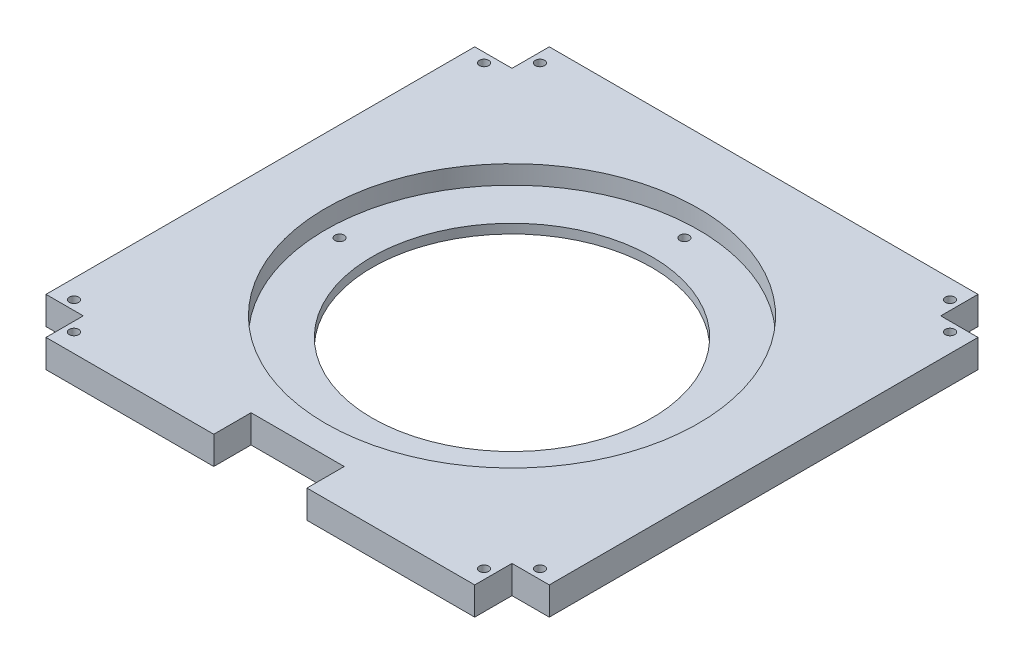
ISO-10303-21;
HEADER;
FILE_DESCRIPTION(('STEP AP214'),'2;1');
FILE_NAME('part.step','',(''),(''),'','','');
FILE_SCHEMA(('AUTOMOTIVE_DESIGN { 1 0 10303 214 1 1 1 1 }'));
ENDSEC;
DATA;
#1=APPLICATION_CONTEXT('core data for automotive mechanical design processes');
#2=APPLICATION_PROTOCOL_DEFINITION('international standard','automotive_design',2000,#1);
#3=PRODUCT_CONTEXT('',#1,'mechanical');
#4=PRODUCT('Part','Part','',(#3));
#5=PRODUCT_RELATED_PRODUCT_CATEGORY('part','',(#4));
#6=PRODUCT_DEFINITION_FORMATION('','',#4);
#7=PRODUCT_DEFINITION_CONTEXT('part definition',#1,'design');
#8=PRODUCT_DEFINITION('design','',#6,#7);
#9=PRODUCT_DEFINITION_SHAPE('','',#8);
#10=(LENGTH_UNIT() NAMED_UNIT(*) SI_UNIT(.MILLI.,.METRE.));
#11=(NAMED_UNIT(*) PLANE_ANGLE_UNIT() SI_UNIT($,.RADIAN.));
#12=(NAMED_UNIT(*) SI_UNIT($,.STERADIAN.) SOLID_ANGLE_UNIT());
#13=UNCERTAINTY_MEASURE_WITH_UNIT(LENGTH_MEASURE(1.E-05),#10,'distance_accuracy_value','');
#14=(GEOMETRIC_REPRESENTATION_CONTEXT(3) GLOBAL_UNCERTAINTY_ASSIGNED_CONTEXT((#13)) GLOBAL_UNIT_ASSIGNED_CONTEXT((#10,
#11,#12)) REPRESENTATION_CONTEXT('',''));
#15=CARTESIAN_POINT('',(0.,0.,0.));
#16=DIRECTION('',(0.,0.,1.));
#17=DIRECTION('',(1.,0.,0.));
#18=AXIS2_PLACEMENT_3D('',#15,#16,#17);
#19=CARTESIAN_POINT('',(0.,15.,0.));
#20=DIRECTION('',(0.,0.,-1.));
#21=DIRECTION('',(-1.,0.,0.));
#22=AXIS2_PLACEMENT_3D('',#19,#20,#21);
#23=PLANE('',#22);
#24=DIRECTION('',(1.,0.,0.));
#25=VECTOR('',#24,1.);
#26=CARTESIAN_POINT('',(0.,15.,0.));
#27=LINE('',#26,#25);
#28=CARTESIAN_POINT('',(160.,15.,0.));
#29=VERTEX_POINT('',#28);
#30=CARTESIAN_POINT('',(250.,15.,0.));
#31=VERTEX_POINT('',#30);
#32=EDGE_CURVE('E164',#29,#31,#27,.T.);
#33=ORIENTED_EDGE('',*,*,#32,.F.);
#34=DIRECTION('',(0.,1.,0.));
#35=VECTOR('',#34,1.);
#36=CARTESIAN_POINT('',(160.,-53.8516480713451,0.));
#37=LINE('',#36,#35);
#38=CARTESIAN_POINT('',(160.,0.,0.));
#39=VERTEX_POINT('',#38);
#40=EDGE_CURVE('E152',#39,#29,#37,.T.);
#41=ORIENTED_EDGE('',*,*,#40,.F.);
#42=DIRECTION('',(1.,0.,0.));
#43=VECTOR('',#42,1.);
#44=CARTESIAN_POINT('',(0.,0.,0.));
#45=LINE('',#44,#43);
#46=CARTESIAN_POINT('',(250.,0.,0.));
#47=VERTEX_POINT('',#46);
#48=EDGE_CURVE('E162',#39,#47,#45,.T.);
#49=ORIENTED_EDGE('',*,*,#48,.T.);
#50=DIRECTION('',(0.,1.,0.));
#51=VECTOR('',#50,1.);
#52=CARTESIAN_POINT('',(250.,0.,0.));
#53=LINE('',#52,#51);
#54=EDGE_CURVE('E241',#47,#31,#53,.T.);
#55=ORIENTED_EDGE('',*,*,#54,.T.);
#56=EDGE_LOOP('',(#33,#41,#49,#55));
#57=FACE_BOUND('',#56,.T.);
#58=ADVANCED_FACE('F33',(#57),#23,.F.);
#59=CARTESIAN_POINT('',(0.,15.,0.));
#60=DIRECTION('',(1.,0.,0.));
#61=DIRECTION('',(0.,0.,-1.));
#62=AXIS2_PLACEMENT_3D('',#59,#60,#61);
#63=PLANE('',#62);
#64=DIRECTION('',(0.,0.,1.));
#65=VECTOR('',#64,1.);
#66=CARTESIAN_POINT('',(0.,0.,0.));
#67=LINE('',#66,#65);
#68=CARTESIAN_POINT('',(0.,0.,-250.));
#69=VERTEX_POINT('',#68);
#70=CARTESIAN_POINT('',(0.,0.,-20.));
#71=VERTEX_POINT('',#70);
#72=EDGE_CURVE('E173',#69,#71,#67,.T.);
#73=ORIENTED_EDGE('',*,*,#72,.T.);
#74=DIRECTION('',(0.,1.,0.));
#75=VECTOR('',#74,1.);
#76=CARTESIAN_POINT('',(0.,0.,-20.));
#77=LINE('',#76,#75);
#78=CARTESIAN_POINT('',(0.,15.,-20.));
#79=VERTEX_POINT('',#78);
#80=EDGE_CURVE('E238',#71,#79,#77,.T.);
#81=ORIENTED_EDGE('',*,*,#80,.T.);
#82=DIRECTION('',(0.,0.,1.));
#83=VECTOR('',#82,1.);
#84=CARTESIAN_POINT('',(0.,15.,0.));
#85=LINE('',#84,#83);
#86=CARTESIAN_POINT('',(0.,15.,-250.));
#87=VERTEX_POINT('',#86);
#88=EDGE_CURVE('E186',#87,#79,#85,.T.);
#89=ORIENTED_EDGE('',*,*,#88,.F.);
#90=DIRECTION('',(0.,1.,0.));
#91=VECTOR('',#90,1.);
#92=CARTESIAN_POINT('',(0.,0.,-250.));
#93=LINE('',#92,#91);
#94=EDGE_CURVE('E200',#69,#87,#93,.T.);
#95=ORIENTED_EDGE('',*,*,#94,.F.);
#96=EDGE_LOOP('',(#73,#81,#89,#95));
#97=FACE_BOUND('',#96,.T.);
#98=ADVANCED_FACE('F35',(#97),#63,.F.);
#99=CARTESIAN_POINT('',(20.,0.,0.));
#100=VERTEX_POINT('',#99);
#101=CARTESIAN_POINT('',(110.,0.,0.));
#102=VERTEX_POINT('',#101);
#103=EDGE_CURVE('E172',#100,#102,#45,.T.);
#104=ORIENTED_EDGE('',*,*,#103,.T.);
#105=DIRECTION('',(0.,1.,0.));
#106=VECTOR('',#105,1.);
#107=CARTESIAN_POINT('',(110.,-53.8516480713451,0.));
#108=LINE('',#107,#106);
#109=CARTESIAN_POINT('',(110.,15.,0.));
#110=VERTEX_POINT('',#109);
#111=EDGE_CURVE('E50',#102,#110,#108,.T.);
#112=ORIENTED_EDGE('',*,*,#111,.T.);
#113=CARTESIAN_POINT('',(20.,15.,0.));
#114=VERTEX_POINT('',#113);
#115=EDGE_CURVE('E197',#114,#110,#27,.T.);
#116=ORIENTED_EDGE('',*,*,#115,.F.);
#117=DIRECTION('',(0.,1.,0.));
#118=VECTOR('',#117,1.);
#119=CARTESIAN_POINT('',(20.,0.,0.));
#120=LINE('',#119,#118);
#121=EDGE_CURVE('E252',#100,#114,#120,.T.);
#122=ORIENTED_EDGE('',*,*,#121,.F.);
#123=EDGE_LOOP('',(#104,#112,#116,#122));
#124=FACE_BOUND('',#123,.T.);
#125=ADVANCED_FACE('F287',(#124),#23,.F.);
#126=CARTESIAN_POINT('',(270.,15.,0.));
#127=DIRECTION('',(-1.,0.,0.));
#128=DIRECTION('',(0.,0.,1.));
#129=AXIS2_PLACEMENT_3D('',#126,#127,#128);
#130=PLANE('',#129);
#131=DIRECTION('',(0.,0.,-1.));
#132=VECTOR('',#131,1.);
#133=CARTESIAN_POINT('',(270.,15.,0.));
#134=LINE('',#133,#132);
#135=CARTESIAN_POINT('',(270.,15.,-20.));
#136=VERTEX_POINT('',#135);
#137=CARTESIAN_POINT('',(270.,15.,-250.));
#138=VERTEX_POINT('',#137);
#139=EDGE_CURVE('E42',#136,#138,#134,.T.);
#140=ORIENTED_EDGE('',*,*,#139,.F.);
#141=DIRECTION('',(0.,1.,0.));
#142=VECTOR('',#141,1.);
#143=CARTESIAN_POINT('',(270.,0.,-20.));
#144=LINE('',#143,#142);
#145=CARTESIAN_POINT('',(270.,0.,-20.));
#146=VERTEX_POINT('',#145);
#147=EDGE_CURVE('E216',#146,#136,#144,.T.);
#148=ORIENTED_EDGE('',*,*,#147,.F.);
#149=DIRECTION('',(0.,0.,-1.));
#150=VECTOR('',#149,1.);
#151=CARTESIAN_POINT('',(270.,0.,0.));
#152=LINE('',#151,#150);
#153=CARTESIAN_POINT('',(270.,0.,-250.));
#154=VERTEX_POINT('',#153);
#155=EDGE_CURVE('E176',#146,#154,#152,.T.);
#156=ORIENTED_EDGE('',*,*,#155,.T.);
#157=DIRECTION('',(0.,1.,0.));
#158=VECTOR('',#157,1.);
#159=CARTESIAN_POINT('',(270.,0.,-250.));
#160=LINE('',#159,#158);
#161=EDGE_CURVE('E217',#154,#138,#160,.T.);
#162=ORIENTED_EDGE('',*,*,#161,.T.);
#163=EDGE_LOOP('',(#140,#148,#156,#162));
#164=FACE_BOUND('',#163,.T.);
#165=ADVANCED_FACE('F215',(#164),#130,.F.);
#166=CARTESIAN_POINT('',(0.,15.,-270.));
#167=DIRECTION('',(0.,0.,1.));
#168=DIRECTION('',(1.,0.,0.));
#169=AXIS2_PLACEMENT_3D('',#166,#167,#168);
#170=PLANE('',#169);
#171=DIRECTION('',(-1.,0.,0.));
#172=VECTOR('',#171,1.);
#173=CARTESIAN_POINT('',(0.,15.,-270.));
#174=LINE('',#173,#172);
#175=CARTESIAN_POINT('',(250.,15.,-270.));
#176=VERTEX_POINT('',#175);
#177=CARTESIAN_POINT('',(20.,15.,-270.));
#178=VERTEX_POINT('',#177);
#179=EDGE_CURVE('E11',#176,#178,#174,.T.);
#180=ORIENTED_EDGE('',*,*,#179,.F.);
#181=DIRECTION('',(0.,1.,0.));
#182=VECTOR('',#181,1.);
#183=CARTESIAN_POINT('',(250.,0.,-270.));
#184=LINE('',#183,#182);
#185=CARTESIAN_POINT('',(250.,0.,-270.));
#186=VERTEX_POINT('',#185);
#187=EDGE_CURVE('E226',#186,#176,#184,.T.);
#188=ORIENTED_EDGE('',*,*,#187,.F.);
#189=DIRECTION('',(-1.,0.,0.));
#190=VECTOR('',#189,1.);
#191=CARTESIAN_POINT('',(0.,0.,-270.));
#192=LINE('',#191,#190);
#193=CARTESIAN_POINT('',(20.,0.,-270.));
#194=VERTEX_POINT('',#193);
#195=EDGE_CURVE('E37',#186,#194,#192,.T.);
#196=ORIENTED_EDGE('',*,*,#195,.T.);
#197=DIRECTION('',(0.,1.,0.));
#198=VECTOR('',#197,1.);
#199=CARTESIAN_POINT('',(20.,0.,-270.));
#200=LINE('',#199,#198);
#201=EDGE_CURVE('E178',#194,#178,#200,.T.);
#202=ORIENTED_EDGE('',*,*,#201,.T.);
#203=EDGE_LOOP('',(#180,#188,#196,#202));
#204=FACE_BOUND('',#203,.T.);
#205=ADVANCED_FACE('F397',(#204),#170,.F.);
#206=CARTESIAN_POINT('',(0.,15.,0.));
#207=DIRECTION('',(0.,-1.,0.));
#208=DIRECTION('',(0.,0.,-1.));
#209=AXIS2_PLACEMENT_3D('',#206,#207,#208);
#210=PLANE('',#209);
#211=CARTESIAN_POINT('',(135.,15.,-135.));
#212=DIRECTION('',(0.,1.,0.));
#213=DIRECTION('',(0.,0.,1.));
#214=AXIS2_PLACEMENT_3D('',#211,#212,#213);
#215=CIRCLE('',#214,100.);
#216=CARTESIAN_POINT('',(135.,15.,-35.));
#217=VERTEX_POINT('',#216);
#218=EDGE_CURVE('E332',#217,#217,#215,.T.);
#219=ORIENTED_EDGE('',*,*,#218,.F.);
#220=EDGE_LOOP('',(#219));
#221=FACE_BOUND('',#220,.T.);
#222=CARTESIAN_POINT('',(25.,15.,-260.));
#223=DIRECTION('',(0.,1.,0.));
#224=DIRECTION('',(0.,0.,1.));
#225=AXIS2_PLACEMENT_3D('',#222,#223,#224);
#226=CIRCLE('',#225,2.5);
#227=CARTESIAN_POINT('',(25.,15.,-257.5));
#228=VERTEX_POINT('',#227);
#229=EDGE_CURVE('E338',#228,#228,#226,.T.);
#230=ORIENTED_EDGE('',*,*,#229,.F.);
#231=EDGE_LOOP('',(#230));
#232=FACE_BOUND('',#231,.T.);
#233=CARTESIAN_POINT('',(245.,15.,-260.));
#234=DIRECTION('',(0.,1.,0.));
#235=DIRECTION('',(0.,0.,1.));
#236=AXIS2_PLACEMENT_3D('',#233,#234,#235);
#237=CIRCLE('',#236,2.5);
#238=CARTESIAN_POINT('',(245.,15.,-257.5));
#239=VERTEX_POINT('',#238);
#240=EDGE_CURVE('E375',#239,#239,#237,.T.);
#241=ORIENTED_EDGE('',*,*,#240,.F.);
#242=EDGE_LOOP('',(#241));
#243=FACE_BOUND('',#242,.T.);
#244=CARTESIAN_POINT('',(260.,15.,-245.));
#245=DIRECTION('',(0.,1.,0.));
#246=DIRECTION('',(0.,0.,1.));
#247=AXIS2_PLACEMENT_3D('',#244,#245,#246);
#248=CIRCLE('',#247,2.50000000000002);
#249=CARTESIAN_POINT('',(260.,15.,-242.5));
#250=VERTEX_POINT('',#249);
#251=EDGE_CURVE('E369',#250,#250,#248,.T.);
#252=ORIENTED_EDGE('',*,*,#251,.F.);
#253=EDGE_LOOP('',(#252));
#254=FACE_BOUND('',#253,.T.);
#255=CARTESIAN_POINT('',(260.,15.,-25.));
#256=DIRECTION('',(0.,1.,0.));
#257=DIRECTION('',(0.,0.,1.));
#258=AXIS2_PLACEMENT_3D('',#255,#256,#257);
#259=CIRCLE('',#258,2.50000000000002);
#260=CARTESIAN_POINT('',(260.,15.,-22.5));
#261=VERTEX_POINT('',#260);
#262=EDGE_CURVE('E363',#261,#261,#259,.T.);
#263=ORIENTED_EDGE('',*,*,#262,.F.);
#264=EDGE_LOOP('',(#263));
#265=FACE_BOUND('',#264,.T.);
#266=CARTESIAN_POINT('',(245.,15.,-10.));
#267=DIRECTION('',(0.,1.,0.));
#268=DIRECTION('',(0.,0.,1.));
#269=AXIS2_PLACEMENT_3D('',#266,#267,#268);
#270=CIRCLE('',#269,2.5);
#271=CARTESIAN_POINT('',(245.,15.,-7.5));
#272=VERTEX_POINT('',#271);
#273=EDGE_CURVE('E357',#272,#272,#270,.T.);
#274=ORIENTED_EDGE('',*,*,#273,.F.);
#275=EDGE_LOOP('',(#274));
#276=FACE_BOUND('',#275,.T.);
#277=CARTESIAN_POINT('',(25.,15.,-9.99999999999997));
#278=DIRECTION('',(0.,1.,0.));
#279=DIRECTION('',(0.,0.,1.));
#280=AXIS2_PLACEMENT_3D('',#277,#278,#279);
#281=CIRCLE('',#280,2.5);
#282=CARTESIAN_POINT('',(25.,15.,-7.49999999999997));
#283=VERTEX_POINT('',#282);
#284=EDGE_CURVE('E351',#283,#283,#281,.T.);
#285=ORIENTED_EDGE('',*,*,#284,.F.);
#286=EDGE_LOOP('',(#285));
#287=FACE_BOUND('',#286,.T.);
#288=CARTESIAN_POINT('',(10.,15.,-25.));
#289=DIRECTION('',(0.,1.,0.));
#290=DIRECTION('',(0.,0.,1.));
#291=AXIS2_PLACEMENT_3D('',#288,#289,#290);
#292=CIRCLE('',#291,2.5);
#293=CARTESIAN_POINT('',(10.,15.,-22.5));
#294=VERTEX_POINT('',#293);
#295=EDGE_CURVE('E345',#294,#294,#292,.T.);
#296=ORIENTED_EDGE('',*,*,#295,.F.);
#297=EDGE_LOOP('',(#296));
#298=FACE_BOUND('',#297,.T.);
#299=CARTESIAN_POINT('',(9.99999999999997,15.,-245.));
#300=DIRECTION('',(0.,1.,0.));
#301=DIRECTION('',(0.,0.,1.));
#302=AXIS2_PLACEMENT_3D('',#299,#300,#301);
#303=CIRCLE('',#302,2.5);
#304=CARTESIAN_POINT('',(9.99999999999997,15.,-242.5));
#305=VERTEX_POINT('',#304);
#306=EDGE_CURVE('E344',#305,#305,#303,.T.);
#307=ORIENTED_EDGE('',*,*,#306,.F.);
#308=EDGE_LOOP('',(#307));
#309=FACE_BOUND('',#308,.T.);
#310=DIRECTION('',(-1.,0.,0.));
#311=VECTOR('',#310,1.);
#312=CARTESIAN_POINT('',(110.,15.,-20.));
#313=LINE('',#312,#311);
#314=CARTESIAN_POINT('',(160.,15.,-20.));
#315=VERTEX_POINT('',#314);
#316=CARTESIAN_POINT('',(110.,15.,-20.));
#317=VERTEX_POINT('',#316);
#318=EDGE_CURVE('E165',#315,#317,#313,.T.);
#319=ORIENTED_EDGE('',*,*,#318,.F.);
#320=DIRECTION('',(0.,0.,-1.));
#321=VECTOR('',#320,1.);
#322=CARTESIAN_POINT('',(160.,15.,0.));
#323=LINE('',#322,#321);
#324=EDGE_CURVE('E291',#29,#315,#323,.T.);
#325=ORIENTED_EDGE('',*,*,#324,.F.);
#326=ORIENTED_EDGE('',*,*,#32,.T.);
#327=DIRECTION('',(0.,0.,1.));
#328=VECTOR('',#327,1.);
#329=CARTESIAN_POINT('',(250.,15.,0.));
#330=LINE('',#329,#328);
#331=CARTESIAN_POINT('',(250.,15.,-20.));
#332=VERTEX_POINT('',#331);
#333=EDGE_CURVE('E235',#332,#31,#330,.T.);
#334=ORIENTED_EDGE('',*,*,#333,.F.);
#335=DIRECTION('',(-1.,0.,0.));
#336=VECTOR('',#335,1.);
#337=CARTESIAN_POINT('',(270.,15.,-20.));
#338=LINE('',#337,#336);
#339=EDGE_CURVE('E214',#136,#332,#338,.T.);
#340=ORIENTED_EDGE('',*,*,#339,.F.);
#341=ORIENTED_EDGE('',*,*,#139,.T.);
#342=DIRECTION('',(1.,0.,0.));
#343=VECTOR('',#342,1.);
#344=CARTESIAN_POINT('',(270.,15.,-250.));
#345=LINE('',#344,#343);
#346=CARTESIAN_POINT('',(250.,15.,-250.));
#347=VERTEX_POINT('',#346);
#348=EDGE_CURVE('E211',#347,#138,#345,.T.);
#349=ORIENTED_EDGE('',*,*,#348,.F.);
#350=DIRECTION('',(0.,0.,1.));
#351=VECTOR('',#350,1.);
#352=CARTESIAN_POINT('',(250.,15.,-270.));
#353=LINE('',#352,#351);
#354=EDGE_CURVE('E243',#176,#347,#353,.T.);
#355=ORIENTED_EDGE('',*,*,#354,.F.);
#356=ORIENTED_EDGE('',*,*,#179,.T.);
#357=DIRECTION('',(0.,0.,-1.));
#358=VECTOR('',#357,1.);
#359=CARTESIAN_POINT('',(20.,15.,-270.));
#360=LINE('',#359,#358);
#361=CARTESIAN_POINT('',(20.,15.,-250.));
#362=VERTEX_POINT('',#361);
#363=EDGE_CURVE('E224',#362,#178,#360,.T.);
#364=ORIENTED_EDGE('',*,*,#363,.F.);
#365=DIRECTION('',(1.,0.,0.));
#366=VECTOR('',#365,1.);
#367=CARTESIAN_POINT('',(0.,15.,-250.));
#368=LINE('',#367,#366);
#369=EDGE_CURVE('E220',#87,#362,#368,.T.);
#370=ORIENTED_EDGE('',*,*,#369,.F.);
#371=ORIENTED_EDGE('',*,*,#88,.T.);
#372=DIRECTION('',(-1.,0.,0.));
#373=VECTOR('',#372,1.);
#374=CARTESIAN_POINT('',(0.,15.,-20.));
#375=LINE('',#374,#373);
#376=CARTESIAN_POINT('',(20.,15.,-20.));
#377=VERTEX_POINT('',#376);
#378=EDGE_CURVE('E250',#377,#79,#375,.T.);
#379=ORIENTED_EDGE('',*,*,#378,.F.);
#380=DIRECTION('',(0.,0.,-1.));
#381=VECTOR('',#380,1.);
#382=CARTESIAN_POINT('',(20.,15.,0.));
#383=LINE('',#382,#381);
#384=EDGE_CURVE('E253',#114,#377,#383,.T.);
#385=ORIENTED_EDGE('',*,*,#384,.F.);
#386=ORIENTED_EDGE('',*,*,#115,.T.);
#387=DIRECTION('',(0.,0.,1.));
#388=VECTOR('',#387,1.);
#389=CARTESIAN_POINT('',(110.,15.,0.));
#390=LINE('',#389,#388);
#391=EDGE_CURVE('E289',#317,#110,#390,.T.);
#392=ORIENTED_EDGE('',*,*,#391,.F.);
#393=EDGE_LOOP('',(#319,#325,#326,#334,#340,#341,#349,#355,#356,#364,#370,#371,#379,#385,#386,#392));
#394=FACE_BOUND('',#393,.T.);
#395=ADVANCED_FACE('F209',(#221,#232,#243,#254,#265,#276,#287,#298,#309,#394),#210,.F.);
#396=CARTESIAN_POINT('',(0.,0.,0.));
#397=DIRECTION('',(0.,-1.,0.));
#398=DIRECTION('',(0.,0.,-1.));
#399=AXIS2_PLACEMENT_3D('',#396,#397,#398);
#400=PLANE('',#399);
#401=DIRECTION('',(0.,0.,-1.));
#402=VECTOR('',#401,1.);
#403=CARTESIAN_POINT('',(160.,0.,0.));
#404=LINE('',#403,#402);
#405=CARTESIAN_POINT('',(160.,0.,-20.));
#406=VERTEX_POINT('',#405);
#407=EDGE_CURVE('E148',#39,#406,#404,.T.);
#408=ORIENTED_EDGE('',*,*,#407,.T.);
#409=DIRECTION('',(-1.,0.,0.));
#410=VECTOR('',#409,1.);
#411=CARTESIAN_POINT('',(110.,0.,-20.));
#412=LINE('',#411,#410);
#413=CARTESIAN_POINT('',(110.,0.,-20.));
#414=VERTEX_POINT('',#413);
#415=EDGE_CURVE('E299',#406,#414,#412,.T.);
#416=ORIENTED_EDGE('',*,*,#415,.T.);
#417=DIRECTION('',(0.,0.,1.));
#418=VECTOR('',#417,1.);
#419=CARTESIAN_POINT('',(110.,0.,0.));
#420=LINE('',#419,#418);
#421=EDGE_CURVE('E296',#414,#102,#420,.T.);
#422=ORIENTED_EDGE('',*,*,#421,.T.);
#423=ORIENTED_EDGE('',*,*,#103,.F.);
#424=DIRECTION('',(0.,0.,-1.));
#425=VECTOR('',#424,1.);
#426=CARTESIAN_POINT('',(20.,0.,0.));
#427=LINE('',#426,#425);
#428=CARTESIAN_POINT('',(20.,0.,-20.));
#429=VERTEX_POINT('',#428);
#430=EDGE_CURVE('E247',#100,#429,#427,.T.);
#431=ORIENTED_EDGE('',*,*,#430,.T.);
#432=DIRECTION('',(-1.,0.,0.));
#433=VECTOR('',#432,1.);
#434=CARTESIAN_POINT('',(0.,0.,-20.));
#435=LINE('',#434,#433);
#436=EDGE_CURVE('E58',#429,#71,#435,.T.);
#437=ORIENTED_EDGE('',*,*,#436,.T.);
#438=ORIENTED_EDGE('',*,*,#72,.F.);
#439=DIRECTION('',(1.,0.,0.));
#440=VECTOR('',#439,1.);
#441=CARTESIAN_POINT('',(0.,0.,-250.));
#442=LINE('',#441,#440);
#443=CARTESIAN_POINT('',(20.,0.,-250.));
#444=VERTEX_POINT('',#443);
#445=EDGE_CURVE('E263',#69,#444,#442,.T.);
#446=ORIENTED_EDGE('',*,*,#445,.T.);
#447=DIRECTION('',(0.,0.,-1.));
#448=VECTOR('',#447,1.);
#449=CARTESIAN_POINT('',(20.,0.,-270.));
#450=LINE('',#449,#448);
#451=EDGE_CURVE('E266',#444,#194,#450,.T.);
#452=ORIENTED_EDGE('',*,*,#451,.T.);
#453=ORIENTED_EDGE('',*,*,#195,.F.);
#454=DIRECTION('',(0.,0.,1.));
#455=VECTOR('',#454,1.);
#456=CARTESIAN_POINT('',(250.,0.,-270.));
#457=LINE('',#456,#455);
#458=CARTESIAN_POINT('',(250.,0.,-250.));
#459=VERTEX_POINT('',#458);
#460=EDGE_CURVE('E387',#186,#459,#457,.T.);
#461=ORIENTED_EDGE('',*,*,#460,.T.);
#462=DIRECTION('',(1.,0.,0.));
#463=VECTOR('',#462,1.);
#464=CARTESIAN_POINT('',(270.,0.,-250.));
#465=LINE('',#464,#463);
#466=EDGE_CURVE('E232',#459,#154,#465,.T.);
#467=ORIENTED_EDGE('',*,*,#466,.T.);
#468=ORIENTED_EDGE('',*,*,#155,.F.);
#469=DIRECTION('',(-1.,0.,0.));
#470=VECTOR('',#469,1.);
#471=CARTESIAN_POINT('',(270.,0.,-20.));
#472=LINE('',#471,#470);
#473=CARTESIAN_POINT('',(250.,0.,-20.));
#474=VERTEX_POINT('',#473);
#475=EDGE_CURVE('E233',#146,#474,#472,.T.);
#476=ORIENTED_EDGE('',*,*,#475,.T.);
#477=DIRECTION('',(0.,0.,1.));
#478=VECTOR('',#477,1.);
#479=CARTESIAN_POINT('',(250.,0.,0.));
#480=LINE('',#479,#478);
#481=EDGE_CURVE('E171',#474,#47,#480,.T.);
#482=ORIENTED_EDGE('',*,*,#481,.T.);
#483=ORIENTED_EDGE('',*,*,#48,.F.);
#484=EDGE_LOOP('',(#408,#416,#422,#423,#431,#437,#438,#446,#452,#453,#461,#467,#468,#476,#482,#483));
#485=FACE_BOUND('',#484,.T.);
#486=CARTESIAN_POINT('',(135.,0.,-227.5));
#487=DIRECTION('',(0.,1.,0.));
#488=DIRECTION('',(0.,0.,1.));
#489=AXIS2_PLACEMENT_3D('',#486,#487,#488);
#490=CIRCLE('',#489,2.5);
#491=CARTESIAN_POINT('',(135.,0.,-225.));
#492=VERTEX_POINT('',#491);
#493=EDGE_CURVE('E317',#492,#492,#490,.T.);
#494=ORIENTED_EDGE('',*,*,#493,.T.);
#495=EDGE_LOOP('',(#494));
#496=FACE_BOUND('',#495,.T.);
#497=CARTESIAN_POINT('',(227.5,0.,-135.));
#498=DIRECTION('',(0.,1.,0.));
#499=DIRECTION('',(0.,0.,1.));
#500=AXIS2_PLACEMENT_3D('',#497,#498,#499);
#501=CIRCLE('',#500,2.5);
#502=CARTESIAN_POINT('',(227.5,0.,-132.5));
#503=VERTEX_POINT('',#502);
#504=EDGE_CURVE('E324',#503,#503,#501,.T.);
#505=ORIENTED_EDGE('',*,*,#504,.T.);
#506=EDGE_LOOP('',(#505));
#507=FACE_BOUND('',#506,.T.);
#508=CARTESIAN_POINT('',(135.,0.,-42.5));
#509=DIRECTION('',(0.,1.,0.));
#510=DIRECTION('',(0.,0.,1.));
#511=AXIS2_PLACEMENT_3D('',#508,#509,#510);
#512=CIRCLE('',#511,2.5);
#513=CARTESIAN_POINT('',(135.,0.,-40.));
#514=VERTEX_POINT('',#513);
#515=EDGE_CURVE('E305',#514,#514,#512,.T.);
#516=ORIENTED_EDGE('',*,*,#515,.T.);
#517=EDGE_LOOP('',(#516));
#518=FACE_BOUND('',#517,.T.);
#519=CARTESIAN_POINT('',(42.5,0.,-135.));
#520=DIRECTION('',(0.,1.,0.));
#521=DIRECTION('',(0.,0.,1.));
#522=AXIS2_PLACEMENT_3D('',#519,#520,#521);
#523=CIRCLE('',#522,2.5);
#524=CARTESIAN_POINT('',(42.5,0.,-132.5));
#525=VERTEX_POINT('',#524);
#526=EDGE_CURVE('E312',#525,#525,#523,.T.);
#527=ORIENTED_EDGE('',*,*,#526,.T.);
#528=EDGE_LOOP('',(#527));
#529=FACE_BOUND('',#528,.T.);
#530=CARTESIAN_POINT('',(135.,0.,-135.));
#531=DIRECTION('',(0.,1.,0.));
#532=DIRECTION('',(0.,0.,1.));
#533=AXIS2_PLACEMENT_3D('',#530,#531,#532);
#534=CIRCLE('',#533,75.);
#535=CARTESIAN_POINT('',(135.,0.,-60.));
#536=VERTEX_POINT('',#535);
#537=EDGE_CURVE('E329',#536,#536,#534,.T.);
#538=ORIENTED_EDGE('',*,*,#537,.T.);
#539=EDGE_LOOP('',(#538));
#540=FACE_BOUND('',#539,.T.);
#541=CARTESIAN_POINT('',(25.,0.,-260.));
#542=DIRECTION('',(0.,1.,0.));
#543=DIRECTION('',(0.,0.,1.));
#544=AXIS2_PLACEMENT_3D('',#541,#542,#543);
#545=CIRCLE('',#544,2.5);
#546=CARTESIAN_POINT('',(25.,0.,-257.5));
#547=VERTEX_POINT('',#546);
#548=EDGE_CURVE('E378',#547,#547,#545,.T.);
#549=ORIENTED_EDGE('',*,*,#548,.T.);
#550=EDGE_LOOP('',(#549));
#551=FACE_BOUND('',#550,.T.);
#552=CARTESIAN_POINT('',(245.,0.,-260.));
#553=DIRECTION('',(0.,1.,0.));
#554=DIRECTION('',(0.,0.,1.));
#555=AXIS2_PLACEMENT_3D('',#552,#553,#554);
#556=CIRCLE('',#555,2.5);
#557=CARTESIAN_POINT('',(245.,0.,-257.5));
#558=VERTEX_POINT('',#557);
#559=EDGE_CURVE('E372',#558,#558,#556,.T.);
#560=ORIENTED_EDGE('',*,*,#559,.T.);
#561=EDGE_LOOP('',(#560));
#562=FACE_BOUND('',#561,.T.);
#563=CARTESIAN_POINT('',(260.,0.,-245.));
#564=DIRECTION('',(0.,1.,0.));
#565=DIRECTION('',(0.,0.,1.));
#566=AXIS2_PLACEMENT_3D('',#563,#564,#565);
#567=CIRCLE('',#566,2.50000000000002);
#568=CARTESIAN_POINT('',(260.,0.,-242.5));
#569=VERTEX_POINT('',#568);
#570=EDGE_CURVE('E366',#569,#569,#567,.T.);
#571=ORIENTED_EDGE('',*,*,#570,.T.);
#572=EDGE_LOOP('',(#571));
#573=FACE_BOUND('',#572,.T.);
#574=CARTESIAN_POINT('',(260.,0.,-25.));
#575=DIRECTION('',(0.,1.,0.));
#576=DIRECTION('',(0.,0.,1.));
#577=AXIS2_PLACEMENT_3D('',#574,#575,#576);
#578=CIRCLE('',#577,2.50000000000002);
#579=CARTESIAN_POINT('',(260.,0.,-22.5));
#580=VERTEX_POINT('',#579);
#581=EDGE_CURVE('E360',#580,#580,#578,.T.);
#582=ORIENTED_EDGE('',*,*,#581,.T.);
#583=EDGE_LOOP('',(#582));
#584=FACE_BOUND('',#583,.T.);
#585=CARTESIAN_POINT('',(245.,0.,-10.));
#586=DIRECTION('',(0.,1.,0.));
#587=DIRECTION('',(0.,0.,1.));
#588=AXIS2_PLACEMENT_3D('',#585,#586,#587);
#589=CIRCLE('',#588,2.5);
#590=CARTESIAN_POINT('',(245.,0.,-7.5));
#591=VERTEX_POINT('',#590);
#592=EDGE_CURVE('E354',#591,#591,#589,.T.);
#593=ORIENTED_EDGE('',*,*,#592,.T.);
#594=EDGE_LOOP('',(#593));
#595=FACE_BOUND('',#594,.T.);
#596=CARTESIAN_POINT('',(25.,0.,-9.99999999999997));
#597=DIRECTION('',(0.,1.,0.));
#598=DIRECTION('',(0.,0.,1.));
#599=AXIS2_PLACEMENT_3D('',#596,#597,#598);
#600=CIRCLE('',#599,2.5);
#601=CARTESIAN_POINT('',(25.,0.,-7.49999999999997));
#602=VERTEX_POINT('',#601);
#603=EDGE_CURVE('E348',#602,#602,#600,.T.);
#604=ORIENTED_EDGE('',*,*,#603,.T.);
#605=EDGE_LOOP('',(#604));
#606=FACE_BOUND('',#605,.T.);
#607=CARTESIAN_POINT('',(10.,0.,-25.));
#608=DIRECTION('',(0.,1.,0.));
#609=DIRECTION('',(0.,0.,1.));
#610=AXIS2_PLACEMENT_3D('',#607,#608,#609);
#611=CIRCLE('',#610,2.5);
#612=CARTESIAN_POINT('',(10.,0.,-22.5));
#613=VERTEX_POINT('',#612);
#614=EDGE_CURVE('E341',#613,#613,#611,.T.);
#615=ORIENTED_EDGE('',*,*,#614,.T.);
#616=EDGE_LOOP('',(#615));
#617=FACE_BOUND('',#616,.T.);
#618=CARTESIAN_POINT('',(9.99999999999997,0.,-245.));
#619=DIRECTION('',(0.,1.,0.));
#620=DIRECTION('',(0.,0.,1.));
#621=AXIS2_PLACEMENT_3D('',#618,#619,#620);
#622=CIRCLE('',#621,2.5);
#623=CARTESIAN_POINT('',(9.99999999999997,0.,-242.5));
#624=VERTEX_POINT('',#623);
#625=EDGE_CURVE('E256',#624,#624,#622,.T.);
#626=ORIENTED_EDGE('',*,*,#625,.T.);
#627=EDGE_LOOP('',(#626));
#628=FACE_BOUND('',#627,.T.);
#629=ADVANCED_FACE('F168',(#485,#496,#507,#518,#529,#540,#551,#562,#573,#584,#595,#606,#617,
#628),#400,.T.);
#630=CARTESIAN_POINT('',(20.,0.,-270.));
#631=DIRECTION('',(1.,0.,0.));
#632=DIRECTION('',(0.,0.,-1.));
#633=AXIS2_PLACEMENT_3D('',#630,#631,#632);
#634=PLANE('',#633);
#635=ORIENTED_EDGE('',*,*,#363,.T.);
#636=ORIENTED_EDGE('',*,*,#201,.F.);
#637=ORIENTED_EDGE('',*,*,#451,.F.);
#638=DIRECTION('',(0.,1.,0.));
#639=VECTOR('',#638,1.);
#640=CARTESIAN_POINT('',(20.,0.,-250.));
#641=LINE('',#640,#639);
#642=EDGE_CURVE('E270',#444,#362,#641,.T.);
#643=ORIENTED_EDGE('',*,*,#642,.T.);
#644=EDGE_LOOP('',(#635,#636,#637,#643));
#645=FACE_BOUND('',#644,.T.);
#646=ADVANCED_FACE('F395',(#645),#634,.F.);
#647=CARTESIAN_POINT('',(0.,0.,-250.));
#648=DIRECTION('',(0.,0.,1.));
#649=DIRECTION('',(1.,0.,0.));
#650=AXIS2_PLACEMENT_3D('',#647,#648,#649);
#651=PLANE('',#650);
#652=ORIENTED_EDGE('',*,*,#369,.T.);
#653=ORIENTED_EDGE('',*,*,#642,.F.);
#654=ORIENTED_EDGE('',*,*,#445,.F.);
#655=ORIENTED_EDGE('',*,*,#94,.T.);
#656=EDGE_LOOP('',(#652,#653,#654,#655));
#657=FACE_BOUND('',#656,.T.);
#658=ADVANCED_FACE('F275',(#657),#651,.F.);
#659=CARTESIAN_POINT('',(270.,0.,-250.));
#660=DIRECTION('',(0.,0.,1.));
#661=DIRECTION('',(1.,0.,0.));
#662=AXIS2_PLACEMENT_3D('',#659,#660,#661);
#663=PLANE('',#662);
#664=ORIENTED_EDGE('',*,*,#348,.T.);
#665=ORIENTED_EDGE('',*,*,#161,.F.);
#666=ORIENTED_EDGE('',*,*,#466,.F.);
#667=DIRECTION('',(0.,1.,0.));
#668=VECTOR('',#667,1.);
#669=CARTESIAN_POINT('',(250.,0.,-250.));
#670=LINE('',#669,#668);
#671=EDGE_CURVE('E221',#459,#347,#670,.T.);
#672=ORIENTED_EDGE('',*,*,#671,.T.);
#673=EDGE_LOOP('',(#664,#665,#666,#672));
#674=FACE_BOUND('',#673,.T.);
#675=ADVANCED_FACE('F393',(#674),#663,.F.);
#676=CARTESIAN_POINT('',(250.,0.,-270.));
#677=DIRECTION('',(-1.,0.,0.));
#678=DIRECTION('',(0.,0.,1.));
#679=AXIS2_PLACEMENT_3D('',#676,#677,#678);
#680=PLANE('',#679);
#681=ORIENTED_EDGE('',*,*,#354,.T.);
#682=ORIENTED_EDGE('',*,*,#671,.F.);
#683=ORIENTED_EDGE('',*,*,#460,.F.);
#684=ORIENTED_EDGE('',*,*,#187,.T.);
#685=EDGE_LOOP('',(#681,#682,#683,#684));
#686=FACE_BOUND('',#685,.T.);
#687=ADVANCED_FACE('F394',(#686),#680,.F.);
#688=CARTESIAN_POINT('',(250.,0.,0.));
#689=DIRECTION('',(-1.,0.,0.));
#690=DIRECTION('',(0.,0.,1.));
#691=AXIS2_PLACEMENT_3D('',#688,#689,#690);
#692=PLANE('',#691);
#693=ORIENTED_EDGE('',*,*,#333,.T.);
#694=ORIENTED_EDGE('',*,*,#54,.F.);
#695=ORIENTED_EDGE('',*,*,#481,.F.);
#696=DIRECTION('',(0.,1.,0.));
#697=VECTOR('',#696,1.);
#698=CARTESIAN_POINT('',(250.,0.,-20.));
#699=LINE('',#698,#697);
#700=EDGE_CURVE('E244',#474,#332,#699,.T.);
#701=ORIENTED_EDGE('',*,*,#700,.T.);
#702=EDGE_LOOP('',(#693,#694,#695,#701));
#703=FACE_BOUND('',#702,.T.);
#704=ADVANCED_FACE('F521',(#703),#692,.F.);
#705=CARTESIAN_POINT('',(270.,0.,-20.));
#706=DIRECTION('',(0.,0.,-1.));
#707=DIRECTION('',(-1.,0.,0.));
#708=AXIS2_PLACEMENT_3D('',#705,#706,#707);
#709=PLANE('',#708);
#710=ORIENTED_EDGE('',*,*,#339,.T.);
#711=ORIENTED_EDGE('',*,*,#700,.F.);
#712=ORIENTED_EDGE('',*,*,#475,.F.);
#713=ORIENTED_EDGE('',*,*,#147,.T.);
#714=EDGE_LOOP('',(#710,#711,#712,#713));
#715=FACE_BOUND('',#714,.T.);
#716=ADVANCED_FACE('F524',(#715),#709,.F.);
#717=CARTESIAN_POINT('',(0.,0.,-20.));
#718=DIRECTION('',(0.,0.,-1.));
#719=DIRECTION('',(-1.,0.,0.));
#720=AXIS2_PLACEMENT_3D('',#717,#718,#719);
#721=PLANE('',#720);
#722=ORIENTED_EDGE('',*,*,#378,.T.);
#723=ORIENTED_EDGE('',*,*,#80,.F.);
#724=ORIENTED_EDGE('',*,*,#436,.F.);
#725=DIRECTION('',(0.,1.,0.));
#726=VECTOR('',#725,1.);
#727=CARTESIAN_POINT('',(20.,0.,-20.));
#728=LINE('',#727,#726);
#729=EDGE_CURVE('E260',#429,#377,#728,.T.);
#730=ORIENTED_EDGE('',*,*,#729,.T.);
#731=EDGE_LOOP('',(#722,#723,#724,#730));
#732=FACE_BOUND('',#731,.T.);
#733=ADVANCED_FACE('F279',(#732),#721,.F.);
#734=CARTESIAN_POINT('',(20.,0.,0.));
#735=DIRECTION('',(1.,0.,0.));
#736=DIRECTION('',(0.,0.,-1.));
#737=AXIS2_PLACEMENT_3D('',#734,#735,#736);
#738=PLANE('',#737);
#739=ORIENTED_EDGE('',*,*,#384,.T.);
#740=ORIENTED_EDGE('',*,*,#729,.F.);
#741=ORIENTED_EDGE('',*,*,#430,.F.);
#742=ORIENTED_EDGE('',*,*,#121,.T.);
#743=EDGE_LOOP('',(#739,#740,#741,#742));
#744=FACE_BOUND('',#743,.T.);
#745=ADVANCED_FACE('F283',(#744),#738,.F.);
#746=CARTESIAN_POINT('',(9.99999999999997,0.,-245.));
#747=DIRECTION('',(0.,1.,0.));
#748=DIRECTION('',(0.,0.,1.));
#749=AXIS2_PLACEMENT_3D('',#746,#747,#748);
#750=CYLINDRICAL_SURFACE('',#749,2.5);
#751=ORIENTED_EDGE('',*,*,#625,.F.);
#752=EDGE_LOOP('',(#751));
#753=FACE_BOUND('',#752,.T.);
#754=ORIENTED_EDGE('',*,*,#306,.T.);
#755=EDGE_LOOP('',(#754));
#756=FACE_BOUND('',#755,.T.);
#757=ADVANCED_FACE('F490',(#753,#756),#750,.F.);
#758=CARTESIAN_POINT('',(10.,0.,-25.));
#759=DIRECTION('',(0.,1.,0.));
#760=DIRECTION('',(0.,0.,1.));
#761=AXIS2_PLACEMENT_3D('',#758,#759,#760);
#762=CYLINDRICAL_SURFACE('',#761,2.5);
#763=ORIENTED_EDGE('',*,*,#614,.F.);
#764=EDGE_LOOP('',(#763));
#765=FACE_BOUND('',#764,.T.);
#766=ORIENTED_EDGE('',*,*,#295,.T.);
#767=EDGE_LOOP('',(#766));
#768=FACE_BOUND('',#767,.T.);
#769=ADVANCED_FACE('F486',(#765,#768),#762,.F.);
#770=CARTESIAN_POINT('',(25.,0.,-9.99999999999997));
#771=DIRECTION('',(0.,1.,0.));
#772=DIRECTION('',(0.,0.,1.));
#773=AXIS2_PLACEMENT_3D('',#770,#771,#772);
#774=CYLINDRICAL_SURFACE('',#773,2.5);
#775=ORIENTED_EDGE('',*,*,#603,.F.);
#776=EDGE_LOOP('',(#775));
#777=FACE_BOUND('',#776,.T.);
#778=ORIENTED_EDGE('',*,*,#284,.T.);
#779=EDGE_LOOP('',(#778));
#780=FACE_BOUND('',#779,.T.);
#781=ADVANCED_FACE('F489',(#777,#780),#774,.F.);
#782=CARTESIAN_POINT('',(245.,0.,-10.));
#783=DIRECTION('',(0.,1.,0.));
#784=DIRECTION('',(0.,0.,1.));
#785=AXIS2_PLACEMENT_3D('',#782,#783,#784);
#786=CYLINDRICAL_SURFACE('',#785,2.5);
#787=ORIENTED_EDGE('',*,*,#592,.F.);
#788=EDGE_LOOP('',(#787));
#789=FACE_BOUND('',#788,.T.);
#790=ORIENTED_EDGE('',*,*,#273,.T.);
#791=EDGE_LOOP('',(#790));
#792=FACE_BOUND('',#791,.T.);
#793=ADVANCED_FACE('F494',(#789,#792),#786,.F.);
#794=CARTESIAN_POINT('',(260.,0.,-25.));
#795=DIRECTION('',(0.,1.,0.));
#796=DIRECTION('',(0.,0.,1.));
#797=AXIS2_PLACEMENT_3D('',#794,#795,#796);
#798=CYLINDRICAL_SURFACE('',#797,2.50000000000002);
#799=ORIENTED_EDGE('',*,*,#581,.F.);
#800=EDGE_LOOP('',(#799));
#801=FACE_BOUND('',#800,.T.);
#802=ORIENTED_EDGE('',*,*,#262,.T.);
#803=EDGE_LOOP('',(#802));
#804=FACE_BOUND('',#803,.T.);
#805=ADVANCED_FACE('F498',(#801,#804),#798,.F.);
#806=CARTESIAN_POINT('',(260.,0.,-245.));
#807=DIRECTION('',(0.,1.,0.));
#808=DIRECTION('',(0.,0.,1.));
#809=AXIS2_PLACEMENT_3D('',#806,#807,#808);
#810=CYLINDRICAL_SURFACE('',#809,2.50000000000002);
#811=ORIENTED_EDGE('',*,*,#570,.F.);
#812=EDGE_LOOP('',(#811));
#813=FACE_BOUND('',#812,.T.);
#814=ORIENTED_EDGE('',*,*,#251,.T.);
#815=EDGE_LOOP('',(#814));
#816=FACE_BOUND('',#815,.T.);
#817=ADVANCED_FACE('F502',(#813,#816),#810,.F.);
#818=CARTESIAN_POINT('',(245.,0.,-260.));
#819=DIRECTION('',(0.,1.,0.));
#820=DIRECTION('',(0.,0.,1.));
#821=AXIS2_PLACEMENT_3D('',#818,#819,#820);
#822=CYLINDRICAL_SURFACE('',#821,2.5);
#823=ORIENTED_EDGE('',*,*,#559,.F.);
#824=EDGE_LOOP('',(#823));
#825=FACE_BOUND('',#824,.T.);
#826=ORIENTED_EDGE('',*,*,#240,.T.);
#827=EDGE_LOOP('',(#826));
#828=FACE_BOUND('',#827,.T.);
#829=ADVANCED_FACE('F506',(#825,#828),#822,.F.);
#830=CARTESIAN_POINT('',(25.,0.,-260.));
#831=DIRECTION('',(0.,1.,0.));
#832=DIRECTION('',(0.,0.,1.));
#833=AXIS2_PLACEMENT_3D('',#830,#831,#832);
#834=CYLINDRICAL_SURFACE('',#833,2.5);
#835=ORIENTED_EDGE('',*,*,#548,.F.);
#836=EDGE_LOOP('',(#835));
#837=FACE_BOUND('',#836,.T.);
#838=ORIENTED_EDGE('',*,*,#229,.T.);
#839=EDGE_LOOP('',(#838));
#840=FACE_BOUND('',#839,.T.);
#841=ADVANCED_FACE('F484',(#837,#840),#834,.F.);
#842=CARTESIAN_POINT('',(135.,5.,-135.));
#843=DIRECTION('',(0.,1.,0.));
#844=DIRECTION('',(0.,0.,1.));
#845=AXIS2_PLACEMENT_3D('',#842,#843,#844);
#846=CYLINDRICAL_SURFACE('',#845,100.);
#847=CARTESIAN_POINT('',(135.,5.,-135.));
#848=DIRECTION('',(0.,1.,0.));
#849=DIRECTION('',(0.,0.,1.));
#850=AXIS2_PLACEMENT_3D('',#847,#848,#849);
#851=CIRCLE('',#850,100.);
#852=CARTESIAN_POINT('',(135.,5.,-35.));
#853=VERTEX_POINT('',#852);
#854=EDGE_CURVE('E335',#853,#853,#851,.T.);
#855=ORIENTED_EDGE('',*,*,#854,.F.);
#856=EDGE_LOOP('',(#855));
#857=FACE_BOUND('',#856,.T.);
#858=ORIENTED_EDGE('',*,*,#218,.T.);
#859=EDGE_LOOP('',(#858));
#860=FACE_BOUND('',#859,.T.);
#861=ADVANCED_FACE('F480',(#857,#860),#846,.F.);
#862=CARTESIAN_POINT('',(135.,5.,-135.));
#863=DIRECTION('',(0.,1.,0.));
#864=DIRECTION('',(0.,0.,1.));
#865=AXIS2_PLACEMENT_3D('',#862,#863,#864);
#866=PLANE('',#865);
#867=CARTESIAN_POINT('',(135.,5.,-135.));
#868=DIRECTION('',(0.,1.,0.));
#869=DIRECTION('',(0.,0.,1.));
#870=AXIS2_PLACEMENT_3D('',#867,#868,#869);
#871=CIRCLE('',#870,75.);
#872=CARTESIAN_POINT('',(135.,5.,-60.));
#873=VERTEX_POINT('',#872);
#874=EDGE_CURVE('E320',#873,#873,#871,.T.);
#875=ORIENTED_EDGE('',*,*,#874,.F.);
#876=EDGE_LOOP('',(#875));
#877=FACE_BOUND('',#876,.T.);
#878=CARTESIAN_POINT('',(135.,5.,-227.5));
#879=DIRECTION('',(0.,1.,0.));
#880=DIRECTION('',(0.,0.,1.));
#881=AXIS2_PLACEMENT_3D('',#878,#879,#880);
#882=CIRCLE('',#881,2.5);
#883=CARTESIAN_POINT('',(135.,5.,-225.));
#884=VERTEX_POINT('',#883);
#885=EDGE_CURVE('E321',#884,#884,#882,.T.);
#886=ORIENTED_EDGE('',*,*,#885,.F.);
#887=EDGE_LOOP('',(#886));
#888=FACE_BOUND('',#887,.T.);
#889=CARTESIAN_POINT('',(227.5,5.,-135.));
#890=DIRECTION('',(0.,1.,0.));
#891=DIRECTION('',(0.,0.,1.));
#892=AXIS2_PLACEMENT_3D('',#889,#890,#891);
#893=CIRCLE('',#892,2.5);
#894=CARTESIAN_POINT('',(227.5,5.,-132.5));
#895=VERTEX_POINT('',#894);
#896=EDGE_CURVE('E308',#895,#895,#893,.T.);
#897=ORIENTED_EDGE('',*,*,#896,.F.);
#898=EDGE_LOOP('',(#897));
#899=FACE_BOUND('',#898,.T.);
#900=CARTESIAN_POINT('',(135.,5.,-42.5));
#901=DIRECTION('',(0.,1.,0.));
#902=DIRECTION('',(0.,0.,1.));
#903=AXIS2_PLACEMENT_3D('',#900,#901,#902);
#904=CIRCLE('',#903,2.5);
#905=CARTESIAN_POINT('',(135.,5.,-40.));
#906=VERTEX_POINT('',#905);
#907=EDGE_CURVE('E309',#906,#906,#904,.T.);
#908=ORIENTED_EDGE('',*,*,#907,.F.);
#909=EDGE_LOOP('',(#908));
#910=FACE_BOUND('',#909,.T.);
#911=CARTESIAN_POINT('',(42.5,5.,-135.));
#912=DIRECTION('',(0.,1.,0.));
#913=DIRECTION('',(0.,0.,1.));
#914=AXIS2_PLACEMENT_3D('',#911,#912,#913);
#915=CIRCLE('',#914,2.5);
#916=CARTESIAN_POINT('',(42.5,5.,-132.5));
#917=VERTEX_POINT('',#916);
#918=EDGE_CURVE('E304',#917,#917,#915,.T.);
#919=ORIENTED_EDGE('',*,*,#918,.F.);
#920=EDGE_LOOP('',(#919));
#921=FACE_BOUND('',#920,.T.);
#922=ORIENTED_EDGE('',*,*,#854,.T.);
#923=EDGE_LOOP('',(#922));
#924=FACE_BOUND('',#923,.T.);
#925=ADVANCED_FACE('F466',(#877,#888,#899,#910,#921,#924),#866,.T.);
#926=CARTESIAN_POINT('',(42.5,0.,-135.));
#927=DIRECTION('',(0.,1.,0.));
#928=DIRECTION('',(0.,0.,1.));
#929=AXIS2_PLACEMENT_3D('',#926,#927,#928);
#930=CYLINDRICAL_SURFACE('',#929,2.5);
#931=ORIENTED_EDGE('',*,*,#526,.F.);
#932=EDGE_LOOP('',(#931));
#933=FACE_BOUND('',#932,.T.);
#934=ORIENTED_EDGE('',*,*,#918,.T.);
#935=EDGE_LOOP('',(#934));
#936=FACE_BOUND('',#935,.T.);
#937=ADVANCED_FACE('F462',(#933,#936),#930,.F.);
#938=CARTESIAN_POINT('',(135.,0.,-42.5));
#939=DIRECTION('',(0.,1.,0.));
#940=DIRECTION('',(0.,0.,1.));
#941=AXIS2_PLACEMENT_3D('',#938,#939,#940);
#942=CYLINDRICAL_SURFACE('',#941,2.5);
#943=ORIENTED_EDGE('',*,*,#515,.F.);
#944=EDGE_LOOP('',(#943));
#945=FACE_BOUND('',#944,.T.);
#946=ORIENTED_EDGE('',*,*,#907,.T.);
#947=EDGE_LOOP('',(#946));
#948=FACE_BOUND('',#947,.T.);
#949=ADVANCED_FACE('F458',(#945,#948),#942,.F.);
#950=CARTESIAN_POINT('',(227.5,0.,-135.));
#951=DIRECTION('',(0.,1.,0.));
#952=DIRECTION('',(0.,0.,1.));
#953=AXIS2_PLACEMENT_3D('',#950,#951,#952);
#954=CYLINDRICAL_SURFACE('',#953,2.5);
#955=ORIENTED_EDGE('',*,*,#504,.F.);
#956=EDGE_LOOP('',(#955));
#957=FACE_BOUND('',#956,.T.);
#958=ORIENTED_EDGE('',*,*,#896,.T.);
#959=EDGE_LOOP('',(#958));
#960=FACE_BOUND('',#959,.T.);
#961=ADVANCED_FACE('F461',(#957,#960),#954,.F.);
#962=CARTESIAN_POINT('',(135.,0.,-227.5));
#963=DIRECTION('',(0.,1.,0.));
#964=DIRECTION('',(0.,0.,1.));
#965=AXIS2_PLACEMENT_3D('',#962,#963,#964);
#966=CYLINDRICAL_SURFACE('',#965,2.5);
#967=ORIENTED_EDGE('',*,*,#493,.F.);
#968=EDGE_LOOP('',(#967));
#969=FACE_BOUND('',#968,.T.);
#970=ORIENTED_EDGE('',*,*,#885,.T.);
#971=EDGE_LOOP('',(#970));
#972=FACE_BOUND('',#971,.T.);
#973=ADVANCED_FACE('F468',(#969,#972),#966,.F.);
#974=CARTESIAN_POINT('',(135.,0.,-135.));
#975=DIRECTION('',(0.,1.,0.));
#976=DIRECTION('',(0.,0.,1.));
#977=AXIS2_PLACEMENT_3D('',#974,#975,#976);
#978=CYLINDRICAL_SURFACE('',#977,75.);
#979=ORIENTED_EDGE('',*,*,#537,.F.);
#980=EDGE_LOOP('',(#979));
#981=FACE_BOUND('',#980,.T.);
#982=ORIENTED_EDGE('',*,*,#874,.T.);
#983=EDGE_LOOP('',(#982));
#984=FACE_BOUND('',#983,.T.);
#985=ADVANCED_FACE('F434',(#981,#984),#978,.F.);
#986=CARTESIAN_POINT('',(160.,-53.8516480713451,0.));
#987=DIRECTION('',(1.,0.,0.));
#988=DIRECTION('',(0.,0.,-1.));
#989=AXIS2_PLACEMENT_3D('',#986,#987,#988);
#990=PLANE('',#989);
#991=ORIENTED_EDGE('',*,*,#40,.T.);
#992=ORIENTED_EDGE('',*,*,#324,.T.);
#993=DIRECTION('',(0.,1.,0.));
#994=VECTOR('',#993,1.);
#995=CARTESIAN_POINT('',(160.,-53.8516480713451,-20.));
#996=LINE('',#995,#994);
#997=EDGE_CURVE('E154',#406,#315,#996,.T.);
#998=ORIENTED_EDGE('',*,*,#997,.F.);
#999=ORIENTED_EDGE('',*,*,#407,.F.);
#1000=EDGE_LOOP('',(#991,#992,#998,#999));
#1001=FACE_BOUND('',#1000,.T.);
#1002=ADVANCED_FACE('F150',(#1001),#990,.F.);
#1003=CARTESIAN_POINT('',(110.,-53.8516480713451,-20.));
#1004=DIRECTION('',(0.,0.,-1.));
#1005=DIRECTION('',(-1.,0.,0.));
#1006=AXIS2_PLACEMENT_3D('',#1003,#1004,#1005);
#1007=PLANE('',#1006);
#1008=ORIENTED_EDGE('',*,*,#997,.T.);
#1009=ORIENTED_EDGE('',*,*,#318,.T.);
#1010=DIRECTION('',(0.,1.,0.));
#1011=VECTOR('',#1010,1.);
#1012=CARTESIAN_POINT('',(110.,-53.8516480713451,-20.));
#1013=LINE('',#1012,#1011);
#1014=EDGE_CURVE('E298',#414,#317,#1013,.T.);
#1015=ORIENTED_EDGE('',*,*,#1014,.F.);
#1016=ORIENTED_EDGE('',*,*,#415,.F.);
#1017=EDGE_LOOP('',(#1008,#1009,#1015,#1016));
#1018=FACE_BOUND('',#1017,.T.);
#1019=ADVANCED_FACE('F433',(#1018),#1007,.F.);
#1020=CARTESIAN_POINT('',(110.,-53.8516480713451,0.));
#1021=DIRECTION('',(-1.,0.,0.));
#1022=DIRECTION('',(0.,0.,1.));
#1023=AXIS2_PLACEMENT_3D('',#1020,#1021,#1022);
#1024=PLANE('',#1023);
#1025=ORIENTED_EDGE('',*,*,#1014,.T.);
#1026=ORIENTED_EDGE('',*,*,#391,.T.);
#1027=ORIENTED_EDGE('',*,*,#111,.F.);
#1028=ORIENTED_EDGE('',*,*,#421,.F.);
#1029=EDGE_LOOP('',(#1025,#1026,#1027,#1028));
#1030=FACE_BOUND('',#1029,.T.);
#1031=ADVANCED_FACE('F444',(#1030),#1024,.F.);
#1032=CLOSED_SHELL('',(#58,#98,#125,#165,#205,#395,#629,#646,#658,#675,#687,#704,#716,#733,#745,
#757,#769,#781,#793,#805,#817,#829,#841,#861,#925,#937,#949,#961,#973,#985,#1002,#1019,#1031));
#1033=MANIFOLD_SOLID_BREP('B2',#1032);
#1034=ADVANCED_BREP_SHAPE_REPRESENTATION('',(#18,#1033),#14);
#1035=SHAPE_DEFINITION_REPRESENTATION(#9,#1034);
ENDSEC;
END-ISO-10303-21;
